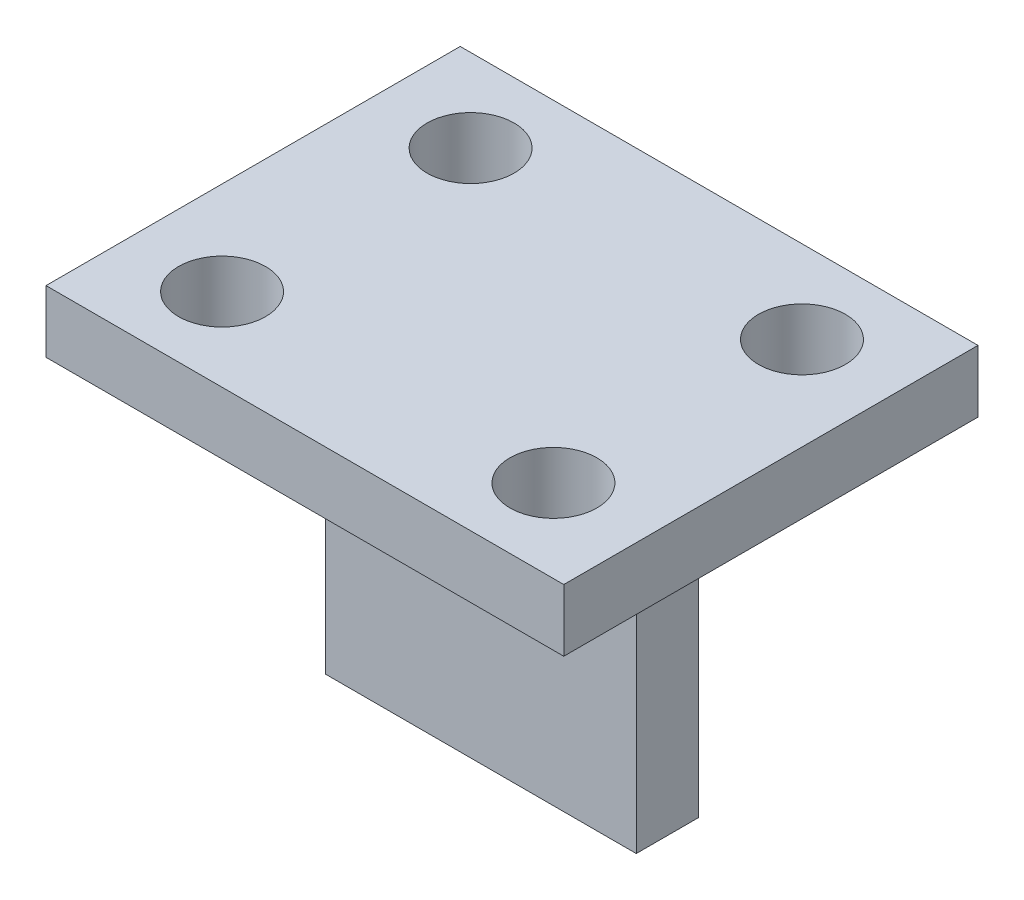
ISO-10303-21;
HEADER;
FILE_DESCRIPTION(('STEP AP214'),'2;1');
FILE_NAME('part.step','',(''),(''),'','','');
FILE_SCHEMA(('AUTOMOTIVE_DESIGN { 1 0 10303 214 1 1 1 1 }'));
ENDSEC;
DATA;
#1=APPLICATION_CONTEXT('core data for automotive mechanical design processes');
#2=APPLICATION_PROTOCOL_DEFINITION('international standard','automotive_design',2000,#1);
#3=PRODUCT_CONTEXT('',#1,'mechanical');
#4=PRODUCT('Part','Part','',(#3));
#5=PRODUCT_RELATED_PRODUCT_CATEGORY('part','',(#4));
#6=PRODUCT_DEFINITION_FORMATION('','',#4);
#7=PRODUCT_DEFINITION_CONTEXT('part definition',#1,'design');
#8=PRODUCT_DEFINITION('design','',#6,#7);
#9=PRODUCT_DEFINITION_SHAPE('','',#8);
#10=(LENGTH_UNIT() NAMED_UNIT(*) SI_UNIT(.MILLI.,.METRE.));
#11=(NAMED_UNIT(*) PLANE_ANGLE_UNIT() SI_UNIT($,.RADIAN.));
#12=(NAMED_UNIT(*) SI_UNIT($,.STERADIAN.) SOLID_ANGLE_UNIT());
#13=UNCERTAINTY_MEASURE_WITH_UNIT(LENGTH_MEASURE(1.E-05),#10,'distance_accuracy_value','');
#14=(GEOMETRIC_REPRESENTATION_CONTEXT(3) GLOBAL_UNCERTAINTY_ASSIGNED_CONTEXT((#13)) GLOBAL_UNIT_ASSIGNED_CONTEXT((#10,
#11,#12)) REPRESENTATION_CONTEXT('',''));
#15=CARTESIAN_POINT('',(0.,0.,0.));
#16=DIRECTION('',(0.,0.,1.));
#17=DIRECTION('',(1.,0.,0.));
#18=AXIS2_PLACEMENT_3D('',#15,#16,#17);
#19=CARTESIAN_POINT('',(12.5,1.5,10.));
#20=DIRECTION('',(-1.,0.,0.));
#21=DIRECTION('',(0.,0.,1.));
#22=AXIS2_PLACEMENT_3D('',#19,#20,#21);
#23=PLANE('',#22);
#24=DIRECTION('',(0.,0.,-1.));
#25=VECTOR('',#24,1.);
#26=CARTESIAN_POINT('',(12.5,-1.5,10.));
#27=LINE('',#26,#25);
#28=CARTESIAN_POINT('',(12.5,-1.5,10.));
#29=VERTEX_POINT('',#28);
#30=CARTESIAN_POINT('',(12.5,-1.5,-10.));
#31=VERTEX_POINT('',#30);
#32=EDGE_CURVE('E120',#29,#31,#27,.T.);
#33=ORIENTED_EDGE('',*,*,#32,.T.);
#34=DIRECTION('',(0.,-1.,0.));
#35=VECTOR('',#34,1.);
#36=CARTESIAN_POINT('',(12.5,1.5,-10.));
#37=LINE('',#36,#35);
#38=CARTESIAN_POINT('',(12.5,1.5,-10.));
#39=VERTEX_POINT('',#38);
#40=EDGE_CURVE('E11',#39,#31,#37,.T.);
#41=ORIENTED_EDGE('',*,*,#40,.F.);
#42=DIRECTION('',(0.,0.,-1.));
#43=VECTOR('',#42,1.);
#44=CARTESIAN_POINT('',(12.5,1.5,10.));
#45=LINE('',#44,#43);
#46=CARTESIAN_POINT('',(12.5,1.5,10.));
#47=VERTEX_POINT('',#46);
#48=EDGE_CURVE('E129',#47,#39,#45,.T.);
#49=ORIENTED_EDGE('',*,*,#48,.F.);
#50=DIRECTION('',(0.,-1.,0.));
#51=VECTOR('',#50,1.);
#52=CARTESIAN_POINT('',(12.5,1.5,10.));
#53=LINE('',#52,#51);
#54=EDGE_CURVE('E138',#47,#29,#53,.T.);
#55=ORIENTED_EDGE('',*,*,#54,.T.);
#56=EDGE_LOOP('',(#33,#41,#49,#55));
#57=FACE_BOUND('',#56,.T.);
#58=ADVANCED_FACE('F36',(#57),#23,.F.);
#59=CARTESIAN_POINT('',(-12.5,1.5,-10.));
#60=DIRECTION('',(0.,0.,1.));
#61=DIRECTION('',(1.,0.,0.));
#62=AXIS2_PLACEMENT_3D('',#59,#60,#61);
#63=PLANE('',#62);
#64=DIRECTION('',(-1.,0.,0.));
#65=VECTOR('',#64,1.);
#66=CARTESIAN_POINT('',(-12.5,-1.5,-10.));
#67=LINE('',#66,#65);
#68=CARTESIAN_POINT('',(-12.5,-1.5,-10.));
#69=VERTEX_POINT('',#68);
#70=EDGE_CURVE('E123',#31,#69,#67,.T.);
#71=ORIENTED_EDGE('',*,*,#70,.T.);
#72=DIRECTION('',(0.,-1.,0.));
#73=VECTOR('',#72,1.);
#74=CARTESIAN_POINT('',(-12.5,1.5,-10.));
#75=LINE('',#74,#73);
#76=CARTESIAN_POINT('',(-12.5,1.5,-10.));
#77=VERTEX_POINT('',#76);
#78=EDGE_CURVE('E43',#77,#69,#75,.T.);
#79=ORIENTED_EDGE('',*,*,#78,.F.);
#80=DIRECTION('',(-1.,0.,0.));
#81=VECTOR('',#80,1.);
#82=CARTESIAN_POINT('',(-12.5,1.5,-10.));
#83=LINE('',#82,#81);
#84=EDGE_CURVE('E132',#39,#77,#83,.T.);
#85=ORIENTED_EDGE('',*,*,#84,.F.);
#86=ORIENTED_EDGE('',*,*,#40,.T.);
#87=EDGE_LOOP('',(#71,#79,#85,#86));
#88=FACE_BOUND('',#87,.T.);
#89=ADVANCED_FACE('F169',(#88),#63,.F.);
#90=CARTESIAN_POINT('',(-12.5,1.5,10.));
#91=DIRECTION('',(1.,0.,0.));
#92=DIRECTION('',(0.,0.,-1.));
#93=AXIS2_PLACEMENT_3D('',#90,#91,#92);
#94=PLANE('',#93);
#95=DIRECTION('',(0.,0.,1.));
#96=VECTOR('',#95,1.);
#97=CARTESIAN_POINT('',(-12.5,-1.5,10.));
#98=LINE('',#97,#96);
#99=CARTESIAN_POINT('',(-12.5,-1.5,10.));
#100=VERTEX_POINT('',#99);
#101=EDGE_CURVE('E141',#69,#100,#98,.T.);
#102=ORIENTED_EDGE('',*,*,#101,.T.);
#103=DIRECTION('',(0.,-1.,0.));
#104=VECTOR('',#103,1.);
#105=CARTESIAN_POINT('',(-12.5,1.5,10.));
#106=LINE('',#105,#104);
#107=CARTESIAN_POINT('',(-12.5,1.5,10.));
#108=VERTEX_POINT('',#107);
#109=EDGE_CURVE('E146',#108,#100,#106,.T.);
#110=ORIENTED_EDGE('',*,*,#109,.F.);
#111=DIRECTION('',(0.,0.,1.));
#112=VECTOR('',#111,1.);
#113=CARTESIAN_POINT('',(-12.5,1.5,10.));
#114=LINE('',#113,#112);
#115=EDGE_CURVE('E135',#77,#108,#114,.T.);
#116=ORIENTED_EDGE('',*,*,#115,.F.);
#117=ORIENTED_EDGE('',*,*,#78,.T.);
#118=EDGE_LOOP('',(#102,#110,#116,#117));
#119=FACE_BOUND('',#118,.T.);
#120=ADVANCED_FACE('F153',(#119),#94,.F.);
#121=CARTESIAN_POINT('',(-12.5,1.5,10.));
#122=DIRECTION('',(0.,0.,-1.));
#123=DIRECTION('',(-1.,0.,0.));
#124=AXIS2_PLACEMENT_3D('',#121,#122,#123);
#125=PLANE('',#124);
#126=DIRECTION('',(1.,0.,0.));
#127=VECTOR('',#126,1.);
#128=CARTESIAN_POINT('',(-12.5,-1.5,10.));
#129=LINE('',#128,#127);
#130=EDGE_CURVE('E133',#100,#29,#129,.T.);
#131=ORIENTED_EDGE('',*,*,#130,.T.);
#132=ORIENTED_EDGE('',*,*,#54,.F.);
#133=DIRECTION('',(1.,0.,0.));
#134=VECTOR('',#133,1.);
#135=CARTESIAN_POINT('',(-12.5,1.5,10.));
#136=LINE('',#135,#134);
#137=EDGE_CURVE('E137',#108,#47,#136,.T.);
#138=ORIENTED_EDGE('',*,*,#137,.F.);
#139=ORIENTED_EDGE('',*,*,#109,.T.);
#140=EDGE_LOOP('',(#131,#132,#138,#139));
#141=FACE_BOUND('',#140,.T.);
#142=ADVANCED_FACE('F162',(#141),#125,.F.);
#143=CARTESIAN_POINT('',(0.,1.5,0.));
#144=DIRECTION('',(0.,-1.,0.));
#145=DIRECTION('',(0.,0.,-1.));
#146=AXIS2_PLACEMENT_3D('',#143,#144,#145);
#147=PLANE('',#146);
#148=CARTESIAN_POINT('',(-8.,1.5,6.));
#149=DIRECTION('',(0.,-1.,0.));
#150=DIRECTION('',(0.,0.,-1.));
#151=AXIS2_PLACEMENT_3D('',#148,#149,#150);
#152=CIRCLE('',#151,2.1);
#153=CARTESIAN_POINT('',(-8.,1.5,3.9));
#154=VERTEX_POINT('',#153);
#155=EDGE_CURVE('E228',#154,#154,#152,.F.);
#156=ORIENTED_EDGE('',*,*,#155,.F.);
#157=EDGE_LOOP('',(#156));
#158=FACE_BOUND('',#157,.T.);
#159=CARTESIAN_POINT('',(8.,1.5,6.));
#160=DIRECTION('',(0.,-1.,0.));
#161=DIRECTION('',(0.,0.,-1.));
#162=AXIS2_PLACEMENT_3D('',#159,#160,#161);
#163=CIRCLE('',#162,2.1);
#164=CARTESIAN_POINT('',(8.,1.5,3.9));
#165=VERTEX_POINT('',#164);
#166=EDGE_CURVE('E224',#165,#165,#163,.F.);
#167=ORIENTED_EDGE('',*,*,#166,.F.);
#168=EDGE_LOOP('',(#167));
#169=FACE_BOUND('',#168,.T.);
#170=CARTESIAN_POINT('',(8.,1.5,-6.));
#171=DIRECTION('',(0.,-1.,0.));
#172=DIRECTION('',(0.,0.,-1.));
#173=AXIS2_PLACEMENT_3D('',#170,#171,#172);
#174=CIRCLE('',#173,2.1);
#175=CARTESIAN_POINT('',(8.,1.5,-8.1));
#176=VERTEX_POINT('',#175);
#177=EDGE_CURVE('E222',#176,#176,#174,.F.);
#178=ORIENTED_EDGE('',*,*,#177,.F.);
#179=EDGE_LOOP('',(#178));
#180=FACE_BOUND('',#179,.T.);
#181=CARTESIAN_POINT('',(-8.,1.5,-6.));
#182=DIRECTION('',(0.,-1.,0.));
#183=DIRECTION('',(0.,0.,-1.));
#184=AXIS2_PLACEMENT_3D('',#181,#182,#183);
#185=CIRCLE('',#184,2.1);
#186=CARTESIAN_POINT('',(-8.,1.5,-8.1));
#187=VERTEX_POINT('',#186);
#188=EDGE_CURVE('E225',#187,#187,#185,.F.);
#189=ORIENTED_EDGE('',*,*,#188,.F.);
#190=EDGE_LOOP('',(#189));
#191=FACE_BOUND('',#190,.T.);
#192=ORIENTED_EDGE('',*,*,#48,.T.);
#193=ORIENTED_EDGE('',*,*,#84,.T.);
#194=ORIENTED_EDGE('',*,*,#115,.T.);
#195=ORIENTED_EDGE('',*,*,#137,.T.);
#196=EDGE_LOOP('',(#192,#193,#194,#195));
#197=FACE_BOUND('',#196,.T.);
#198=ADVANCED_FACE('F168',(#158,#169,#180,#191,#197),#147,.F.);
#199=CARTESIAN_POINT('',(0.,-1.5,0.));
#200=DIRECTION('',(0.,-1.,0.));
#201=DIRECTION('',(0.,0.,-1.));
#202=AXIS2_PLACEMENT_3D('',#199,#200,#201);
#203=PLANE('',#202);
#204=CARTESIAN_POINT('',(-8.,-1.5,6.));
#205=DIRECTION('',(0.,-1.,0.));
#206=DIRECTION('',(0.,0.,-1.));
#207=AXIS2_PLACEMENT_3D('',#204,#205,#206);
#208=CIRCLE('',#207,2.1);
#209=CARTESIAN_POINT('',(-8.,-1.5,3.9));
#210=VERTEX_POINT('',#209);
#211=EDGE_CURVE('E258',#210,#210,#208,.F.);
#212=ORIENTED_EDGE('',*,*,#211,.T.);
#213=EDGE_LOOP('',(#212));
#214=FACE_BOUND('',#213,.T.);
#215=CARTESIAN_POINT('',(8.,-1.5,6.));
#216=DIRECTION('',(0.,-1.,0.));
#217=DIRECTION('',(0.,0.,-1.));
#218=AXIS2_PLACEMENT_3D('',#215,#216,#217);
#219=CIRCLE('',#218,2.1);
#220=CARTESIAN_POINT('',(8.,-1.5,3.9));
#221=VERTEX_POINT('',#220);
#222=EDGE_CURVE('E261',#221,#221,#219,.F.);
#223=ORIENTED_EDGE('',*,*,#222,.T.);
#224=EDGE_LOOP('',(#223));
#225=FACE_BOUND('',#224,.T.);
#226=CARTESIAN_POINT('',(8.,-1.5,-6.));
#227=DIRECTION('',(0.,-1.,0.));
#228=DIRECTION('',(0.,0.,-1.));
#229=AXIS2_PLACEMENT_3D('',#226,#227,#228);
#230=CIRCLE('',#229,2.1);
#231=CARTESIAN_POINT('',(8.,-1.5,-8.1));
#232=VERTEX_POINT('',#231);
#233=EDGE_CURVE('E219',#232,#232,#230,.F.);
#234=ORIENTED_EDGE('',*,*,#233,.T.);
#235=EDGE_LOOP('',(#234));
#236=FACE_BOUND('',#235,.T.);
#237=CARTESIAN_POINT('',(-8.,-1.5,-6.));
#238=DIRECTION('',(0.,-1.,0.));
#239=DIRECTION('',(0.,0.,-1.));
#240=AXIS2_PLACEMENT_3D('',#237,#238,#239);
#241=CIRCLE('',#240,2.1);
#242=CARTESIAN_POINT('',(-8.,-1.5,-8.1));
#243=VERTEX_POINT('',#242);
#244=EDGE_CURVE('E231',#243,#243,#241,.F.);
#245=ORIENTED_EDGE('',*,*,#244,.T.);
#246=EDGE_LOOP('',(#245));
#247=FACE_BOUND('',#246,.T.);
#248=DIRECTION('',(0.,0.,1.));
#249=VECTOR('',#248,1.);
#250=CARTESIAN_POINT('',(7.5,-1.5,-1.5));
#251=LINE('',#250,#249);
#252=CARTESIAN_POINT('',(7.5,-1.5,-1.5));
#253=VERTEX_POINT('',#252);
#254=CARTESIAN_POINT('',(7.5,-1.5,1.5));
#255=VERTEX_POINT('',#254);
#256=EDGE_CURVE('E50',#253,#255,#251,.T.);
#257=ORIENTED_EDGE('',*,*,#256,.F.);
#258=DIRECTION('',(1.,0.,0.));
#259=VECTOR('',#258,1.);
#260=CARTESIAN_POINT('',(-7.5,-1.5,-1.5));
#261=LINE('',#260,#259);
#262=CARTESIAN_POINT('',(-7.5,-1.5,-1.5));
#263=VERTEX_POINT('',#262);
#264=EDGE_CURVE('E54',#263,#253,#261,.T.);
#265=ORIENTED_EDGE('',*,*,#264,.F.);
#266=DIRECTION('',(0.,0.,-1.));
#267=VECTOR('',#266,1.);
#268=CARTESIAN_POINT('',(-7.5,-1.5,-1.5));
#269=LINE('',#268,#267);
#270=CARTESIAN_POINT('',(-7.5,-1.5,1.5));
#271=VERTEX_POINT('',#270);
#272=EDGE_CURVE('E243',#271,#263,#269,.T.);
#273=ORIENTED_EDGE('',*,*,#272,.F.);
#274=DIRECTION('',(-1.,0.,0.));
#275=VECTOR('',#274,1.);
#276=CARTESIAN_POINT('',(-7.5,-1.5,1.5));
#277=LINE('',#276,#275);
#278=EDGE_CURVE('E241',#255,#271,#277,.T.);
#279=ORIENTED_EDGE('',*,*,#278,.F.);
#280=EDGE_LOOP('',(#257,#265,#273,#279));
#281=FACE_BOUND('',#280,.T.);
#282=ORIENTED_EDGE('',*,*,#32,.F.);
#283=ORIENTED_EDGE('',*,*,#130,.F.);
#284=ORIENTED_EDGE('',*,*,#101,.F.);
#285=ORIENTED_EDGE('',*,*,#70,.F.);
#286=EDGE_LOOP('',(#282,#283,#284,#285));
#287=FACE_BOUND('',#286,.T.);
#288=ADVANCED_FACE('F159',(#214,#225,#236,#247,#281,#287),#203,.T.);
#289=CARTESIAN_POINT('',(7.5,-16.5,-1.5));
#290=DIRECTION('',(-1.,0.,0.));
#291=DIRECTION('',(0.,0.,1.));
#292=AXIS2_PLACEMENT_3D('',#289,#290,#291);
#293=PLANE('',#292);
#294=ORIENTED_EDGE('',*,*,#256,.T.);
#295=DIRECTION('',(0.,1.,0.));
#296=VECTOR('',#295,1.);
#297=CARTESIAN_POINT('',(7.5,-16.5,1.5));
#298=LINE('',#297,#296);
#299=CARTESIAN_POINT('',(7.5,-16.5,1.5));
#300=VERTEX_POINT('',#299);
#301=EDGE_CURVE('E103',#300,#255,#298,.T.);
#302=ORIENTED_EDGE('',*,*,#301,.F.);
#303=DIRECTION('',(0.,0.,1.));
#304=VECTOR('',#303,1.);
#305=CARTESIAN_POINT('',(7.5,-16.5,-1.5));
#306=LINE('',#305,#304);
#307=CARTESIAN_POINT('',(7.5,-16.5,-1.5));
#308=VERTEX_POINT('',#307);
#309=EDGE_CURVE('E109',#308,#300,#306,.T.);
#310=ORIENTED_EDGE('',*,*,#309,.F.);
#311=DIRECTION('',(0.,1.,0.));
#312=VECTOR('',#311,1.);
#313=CARTESIAN_POINT('',(7.5,-16.5,-1.5));
#314=LINE('',#313,#312);
#315=EDGE_CURVE('E239',#308,#253,#314,.T.);
#316=ORIENTED_EDGE('',*,*,#315,.T.);
#317=EDGE_LOOP('',(#294,#302,#310,#316));
#318=FACE_BOUND('',#317,.T.);
#319=ADVANCED_FACE('F119',(#318),#293,.F.);
#320=CARTESIAN_POINT('',(-7.5,-16.5,1.5));
#321=DIRECTION('',(0.,0.,-1.));
#322=DIRECTION('',(-1.,0.,0.));
#323=AXIS2_PLACEMENT_3D('',#320,#321,#322);
#324=PLANE('',#323);
#325=ORIENTED_EDGE('',*,*,#278,.T.);
#326=DIRECTION('',(0.,1.,0.));
#327=VECTOR('',#326,1.);
#328=CARTESIAN_POINT('',(-7.5,-16.5,1.5));
#329=LINE('',#328,#327);
#330=CARTESIAN_POINT('',(-7.5,-16.5,1.5));
#331=VERTEX_POINT('',#330);
#332=EDGE_CURVE('E105',#331,#271,#329,.T.);
#333=ORIENTED_EDGE('',*,*,#332,.F.);
#334=DIRECTION('',(-1.,0.,0.));
#335=VECTOR('',#334,1.);
#336=CARTESIAN_POINT('',(-7.5,-16.5,1.5));
#337=LINE('',#336,#335);
#338=EDGE_CURVE('E98',#300,#331,#337,.T.);
#339=ORIENTED_EDGE('',*,*,#338,.F.);
#340=ORIENTED_EDGE('',*,*,#301,.T.);
#341=EDGE_LOOP('',(#325,#333,#339,#340));
#342=FACE_BOUND('',#341,.T.);
#343=ADVANCED_FACE('F101',(#342),#324,.F.);
#344=CARTESIAN_POINT('',(-7.5,-16.5,-1.5));
#345=DIRECTION('',(1.,0.,0.));
#346=DIRECTION('',(0.,0.,-1.));
#347=AXIS2_PLACEMENT_3D('',#344,#345,#346);
#348=PLANE('',#347);
#349=ORIENTED_EDGE('',*,*,#272,.T.);
#350=DIRECTION('',(0.,1.,0.));
#351=VECTOR('',#350,1.);
#352=CARTESIAN_POINT('',(-7.5,-16.5,-1.5));
#353=LINE('',#352,#351);
#354=CARTESIAN_POINT('',(-7.5,-16.5,-1.5));
#355=VERTEX_POINT('',#354);
#356=EDGE_CURVE('E125',#355,#263,#353,.T.);
#357=ORIENTED_EDGE('',*,*,#356,.F.);
#358=DIRECTION('',(0.,0.,-1.));
#359=VECTOR('',#358,1.);
#360=CARTESIAN_POINT('',(-7.5,-16.5,-1.5));
#361=LINE('',#360,#359);
#362=EDGE_CURVE('E108',#331,#355,#361,.T.);
#363=ORIENTED_EDGE('',*,*,#362,.F.);
#364=ORIENTED_EDGE('',*,*,#332,.T.);
#365=EDGE_LOOP('',(#349,#357,#363,#364));
#366=FACE_BOUND('',#365,.T.);
#367=ADVANCED_FACE('F189',(#366),#348,.F.);
#368=CARTESIAN_POINT('',(-7.5,-16.5,-1.5));
#369=DIRECTION('',(0.,0.,1.));
#370=DIRECTION('',(1.,0.,0.));
#371=AXIS2_PLACEMENT_3D('',#368,#369,#370);
#372=PLANE('',#371);
#373=ORIENTED_EDGE('',*,*,#264,.T.);
#374=ORIENTED_EDGE('',*,*,#315,.F.);
#375=DIRECTION('',(1.,0.,0.));
#376=VECTOR('',#375,1.);
#377=CARTESIAN_POINT('',(-7.5,-16.5,-1.5));
#378=LINE('',#377,#376);
#379=EDGE_CURVE('E114',#355,#308,#378,.T.);
#380=ORIENTED_EDGE('',*,*,#379,.F.);
#381=ORIENTED_EDGE('',*,*,#356,.T.);
#382=EDGE_LOOP('',(#373,#374,#380,#381));
#383=FACE_BOUND('',#382,.T.);
#384=ADVANCED_FACE('F192',(#383),#372,.F.);
#385=CARTESIAN_POINT('',(0.,-16.5,0.));
#386=DIRECTION('',(0.,1.,0.));
#387=DIRECTION('',(0.,0.,1.));
#388=AXIS2_PLACEMENT_3D('',#385,#386,#387);
#389=PLANE('',#388);
#390=ORIENTED_EDGE('',*,*,#309,.T.);
#391=ORIENTED_EDGE('',*,*,#338,.T.);
#392=ORIENTED_EDGE('',*,*,#362,.T.);
#393=ORIENTED_EDGE('',*,*,#379,.T.);
#394=EDGE_LOOP('',(#390,#391,#392,#393));
#395=FACE_BOUND('',#394,.T.);
#396=ADVANCED_FACE('F112',(#395),#389,.F.);
#397=CARTESIAN_POINT('',(-8.,1.500012,-6.));
#398=DIRECTION('',(0.,-1.,0.));
#399=DIRECTION('',(0.,0.,-1.));
#400=AXIS2_PLACEMENT_3D('',#397,#398,#399);
#401=CYLINDRICAL_SURFACE('',#400,2.1);
#402=ORIENTED_EDGE('',*,*,#244,.F.);
#403=EDGE_LOOP('',(#402));
#404=FACE_BOUND('',#403,.T.);
#405=ORIENTED_EDGE('',*,*,#188,.T.);
#406=EDGE_LOOP('',(#405));
#407=FACE_BOUND('',#406,.T.);
#408=ADVANCED_FACE('F199',(#404,#407),#401,.F.);
#409=CARTESIAN_POINT('',(8.,1.500012,-6.));
#410=DIRECTION('',(0.,-1.,0.));
#411=DIRECTION('',(0.,0.,-1.));
#412=AXIS2_PLACEMENT_3D('',#409,#410,#411);
#413=CYLINDRICAL_SURFACE('',#412,2.1);
#414=ORIENTED_EDGE('',*,*,#233,.F.);
#415=EDGE_LOOP('',(#414));
#416=FACE_BOUND('',#415,.T.);
#417=ORIENTED_EDGE('',*,*,#177,.T.);
#418=EDGE_LOOP('',(#417));
#419=FACE_BOUND('',#418,.T.);
#420=ADVANCED_FACE('F202',(#416,#419),#413,.F.);
#421=CARTESIAN_POINT('',(8.,1.500012,6.));
#422=DIRECTION('',(0.,-1.,0.));
#423=DIRECTION('',(0.,0.,-1.));
#424=AXIS2_PLACEMENT_3D('',#421,#422,#423);
#425=CYLINDRICAL_SURFACE('',#424,2.1);
#426=ORIENTED_EDGE('',*,*,#222,.F.);
#427=EDGE_LOOP('',(#426));
#428=FACE_BOUND('',#427,.T.);
#429=ORIENTED_EDGE('',*,*,#166,.T.);
#430=EDGE_LOOP('',(#429));
#431=FACE_BOUND('',#430,.T.);
#432=ADVANCED_FACE('F207',(#428,#431),#425,.F.);
#433=CARTESIAN_POINT('',(-8.,1.500012,6.));
#434=DIRECTION('',(0.,-1.,0.));
#435=DIRECTION('',(0.,0.,-1.));
#436=AXIS2_PLACEMENT_3D('',#433,#434,#435);
#437=CYLINDRICAL_SURFACE('',#436,2.1);
#438=ORIENTED_EDGE('',*,*,#211,.F.);
#439=EDGE_LOOP('',(#438));
#440=FACE_BOUND('',#439,.T.);
#441=ORIENTED_EDGE('',*,*,#155,.T.);
#442=EDGE_LOOP('',(#441));
#443=FACE_BOUND('',#442,.T.);
#444=ADVANCED_FACE('F204',(#440,#443),#437,.F.);
#445=CLOSED_SHELL('',(#58,#89,#120,#142,#198,#288,#319,#343,#367,#384,#396,#408,#420,#432,#444));
#446=MANIFOLD_SOLID_BREP('B2',#445);
#447=ADVANCED_BREP_SHAPE_REPRESENTATION('',(#18,#446),#14);
#448=SHAPE_DEFINITION_REPRESENTATION(#9,#447);
ENDSEC;
END-ISO-10303-21;
